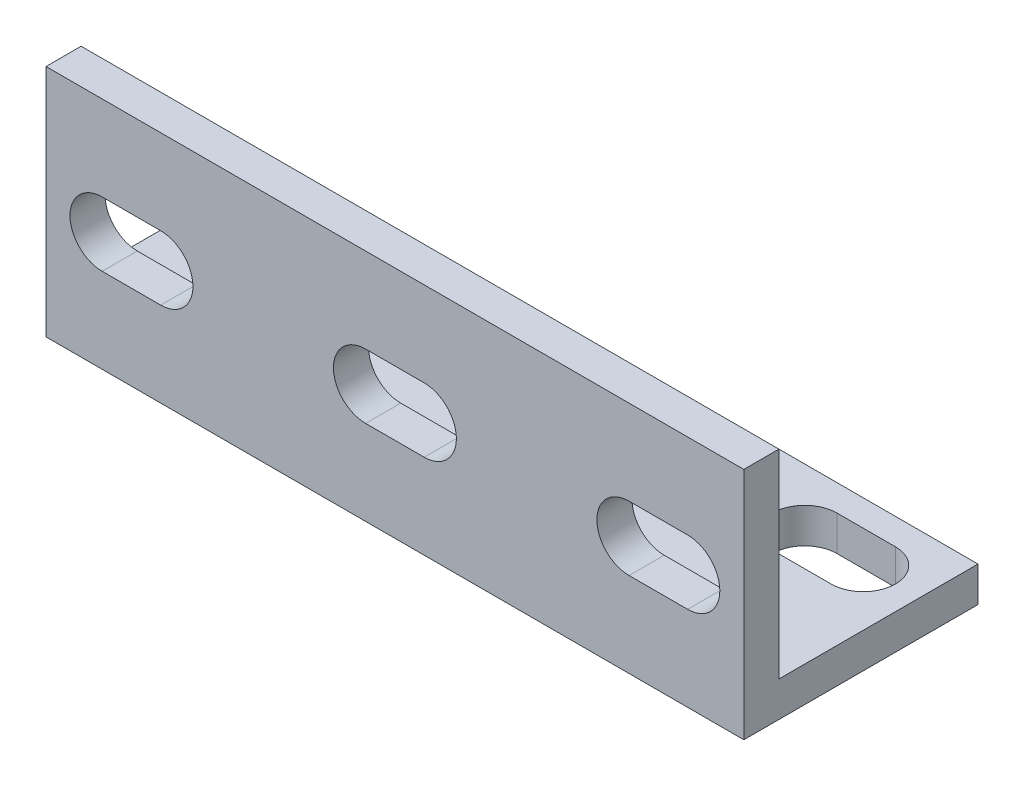
ISO-10303-21;
HEADER;
FILE_DESCRIPTION(('STEP AP214'),'2;1');
FILE_NAME('part.step','',(''),(''),'','','');
FILE_SCHEMA(('AUTOMOTIVE_DESIGN { 1 0 10303 214 1 1 1 1 }'));
ENDSEC;
DATA;
#1=APPLICATION_CONTEXT('core data for automotive mechanical design processes');
#2=APPLICATION_PROTOCOL_DEFINITION('international standard','automotive_design',2000,#1);
#3=PRODUCT_CONTEXT('',#1,'mechanical');
#4=PRODUCT('Part','Part','',(#3));
#5=PRODUCT_RELATED_PRODUCT_CATEGORY('part','',(#4));
#6=PRODUCT_DEFINITION_FORMATION('','',#4);
#7=PRODUCT_DEFINITION_CONTEXT('part definition',#1,'design');
#8=PRODUCT_DEFINITION('design','',#6,#7);
#9=PRODUCT_DEFINITION_SHAPE('','',#8);
#10=(LENGTH_UNIT() NAMED_UNIT(*) SI_UNIT(.MILLI.,.METRE.));
#11=(NAMED_UNIT(*) PLANE_ANGLE_UNIT() SI_UNIT($,.RADIAN.));
#12=(NAMED_UNIT(*) SI_UNIT($,.STERADIAN.) SOLID_ANGLE_UNIT());
#13=UNCERTAINTY_MEASURE_WITH_UNIT(LENGTH_MEASURE(1.E-05),#10,'distance_accuracy_value','');
#14=(GEOMETRIC_REPRESENTATION_CONTEXT(3) GLOBAL_UNCERTAINTY_ASSIGNED_CONTEXT((#13)) GLOBAL_UNIT_ASSIGNED_CONTEXT((#10,
#11,#12)) REPRESENTATION_CONTEXT('',''));
#15=CARTESIAN_POINT('',(0.,0.,0.));
#16=DIRECTION('',(0.,0.,1.));
#17=DIRECTION('',(1.,0.,0.));
#18=AXIS2_PLACEMENT_3D('',#15,#16,#17);
#19=CARTESIAN_POINT('',(-59.6,20.,-3.));
#20=DIRECTION('',(0.,1.,0.));
#21=DIRECTION('',(0.,0.,1.));
#22=AXIS2_PLACEMENT_3D('',#19,#20,#21);
#23=PLANE('',#22);
#24=DIRECTION('',(0.,0.,1.));
#25=VECTOR('',#24,1.);
#26=CARTESIAN_POINT('',(0.,20.,-3.));
#27=LINE('',#26,#25);
#28=CARTESIAN_POINT('',(0.,20.,-3.));
#29=VERTEX_POINT('',#28);
#30=CARTESIAN_POINT('',(0.,20.,0.));
#31=VERTEX_POINT('',#30);
#32=EDGE_CURVE('E416',#29,#31,#27,.T.);
#33=ORIENTED_EDGE('',*,*,#32,.F.);
#34=DIRECTION('',(1.,0.,0.));
#35=VECTOR('',#34,1.);
#36=CARTESIAN_POINT('',(-59.6,20.,-3.));
#37=LINE('',#36,#35);
#38=CARTESIAN_POINT('',(-59.6,20.,-3.));
#39=VERTEX_POINT('',#38);
#40=EDGE_CURVE('E11',#39,#29,#37,.T.);
#41=ORIENTED_EDGE('',*,*,#40,.F.);
#42=DIRECTION('',(0.,0.,1.));
#43=VECTOR('',#42,1.);
#44=CARTESIAN_POINT('',(-59.6,20.,-3.));
#45=LINE('',#44,#43);
#46=CARTESIAN_POINT('',(-59.6,20.,0.));
#47=VERTEX_POINT('',#46);
#48=EDGE_CURVE('E423',#39,#47,#45,.T.);
#49=ORIENTED_EDGE('',*,*,#48,.T.);
#50=DIRECTION('',(1.,0.,0.));
#51=VECTOR('',#50,1.);
#52=CARTESIAN_POINT('',(-59.6,20.,0.));
#53=LINE('',#52,#51);
#54=EDGE_CURVE('E35',#47,#31,#53,.T.);
#55=ORIENTED_EDGE('',*,*,#54,.T.);
#56=EDGE_LOOP('',(#33,#41,#49,#55));
#57=FACE_BOUND('',#56,.T.);
#58=ADVANCED_FACE('F32',(#57),#23,.T.);
#59=CARTESIAN_POINT('',(-59.6,3.,-3.));
#60=DIRECTION('',(0.,0.,-1.));
#61=DIRECTION('',(0.,1.,0.));
#62=AXIS2_PLACEMENT_3D('',#59,#60,#61);
#63=PLANE('',#62);
#64=CARTESIAN_POINT('',(-49.8,10.,-3.));
#65=DIRECTION('',(0.,0.,-1.));
#66=DIRECTION('',(0.,1.,0.));
#67=AXIS2_PLACEMENT_3D('',#64,#65,#66);
#68=CIRCLE('',#67,2.75);
#69=CARTESIAN_POINT('',(-49.8,12.75,-3.));
#70=VERTEX_POINT('',#69);
#71=CARTESIAN_POINT('',(-49.8,7.25000000000001,-3.));
#72=VERTEX_POINT('',#71);
#73=EDGE_CURVE('E323',#70,#72,#68,.T.);
#74=ORIENTED_EDGE('',*,*,#73,.F.);
#75=DIRECTION('',(-1.,0.,0.));
#76=VECTOR('',#75,1.);
#77=CARTESIAN_POINT('',(-49.8,12.75,-3.));
#78=LINE('',#77,#76);
#79=CARTESIAN_POINT('',(-54.8,12.75,-3.));
#80=VERTEX_POINT('',#79);
#81=EDGE_CURVE('E334',#70,#80,#78,.T.);
#82=ORIENTED_EDGE('',*,*,#81,.T.);
#83=CARTESIAN_POINT('',(-54.8,10.,-3.));
#84=DIRECTION('',(0.,0.,-1.));
#85=DIRECTION('',(0.,1.,0.));
#86=AXIS2_PLACEMENT_3D('',#83,#84,#85);
#87=CIRCLE('',#86,2.75);
#88=CARTESIAN_POINT('',(-54.8,7.25000000000001,-3.));
#89=VERTEX_POINT('',#88);
#90=EDGE_CURVE('E347',#89,#80,#87,.T.);
#91=ORIENTED_EDGE('',*,*,#90,.F.);
#92=DIRECTION('',(-1.,0.,0.));
#93=VECTOR('',#92,1.);
#94=CARTESIAN_POINT('',(-49.8,7.25000000000001,-3.));
#95=LINE('',#94,#93);
#96=EDGE_CURVE('E344',#72,#89,#95,.T.);
#97=ORIENTED_EDGE('',*,*,#96,.F.);
#98=EDGE_LOOP('',(#74,#82,#91,#97));
#99=FACE_BOUND('',#98,.T.);
#100=CARTESIAN_POINT('',(-4.8,10.,-3.));
#101=DIRECTION('',(0.,0.,-1.));
#102=DIRECTION('',(0.,1.,0.));
#103=AXIS2_PLACEMENT_3D('',#100,#101,#102);
#104=CIRCLE('',#103,2.75);
#105=CARTESIAN_POINT('',(-4.8,12.75,-3.));
#106=VERTEX_POINT('',#105);
#107=CARTESIAN_POINT('',(-4.80000000000001,7.25000000000001,-3.));
#108=VERTEX_POINT('',#107);
#109=EDGE_CURVE('E354',#106,#108,#104,.T.);
#110=ORIENTED_EDGE('',*,*,#109,.F.);
#111=DIRECTION('',(-1.,0.,0.));
#112=VECTOR('',#111,1.);
#113=CARTESIAN_POINT('',(-4.8,12.75,-3.));
#114=LINE('',#113,#112);
#115=CARTESIAN_POINT('',(-9.8,12.75,-3.));
#116=VERTEX_POINT('',#115);
#117=EDGE_CURVE('E365',#106,#116,#114,.T.);
#118=ORIENTED_EDGE('',*,*,#117,.T.);
#119=CARTESIAN_POINT('',(-9.8,10.,-3.));
#120=DIRECTION('',(0.,0.,-1.));
#121=DIRECTION('',(0.,1.,0.));
#122=AXIS2_PLACEMENT_3D('',#119,#120,#121);
#123=CIRCLE('',#122,2.75);
#124=CARTESIAN_POINT('',(-9.8,7.25000000000001,-3.));
#125=VERTEX_POINT('',#124);
#126=EDGE_CURVE('E378',#125,#116,#123,.T.);
#127=ORIENTED_EDGE('',*,*,#126,.F.);
#128=DIRECTION('',(-1.,0.,0.));
#129=VECTOR('',#128,1.);
#130=CARTESIAN_POINT('',(-4.8,7.25000000000001,-3.));
#131=LINE('',#130,#129);
#132=EDGE_CURVE('E375',#108,#125,#131,.T.);
#133=ORIENTED_EDGE('',*,*,#132,.F.);
#134=EDGE_LOOP('',(#110,#118,#127,#133));
#135=FACE_BOUND('',#134,.T.);
#136=CARTESIAN_POINT('',(-27.3,10.,-3.));
#137=DIRECTION('',(0.,0.,-1.));
#138=DIRECTION('',(0.,1.,0.));
#139=AXIS2_PLACEMENT_3D('',#136,#137,#138);
#140=CIRCLE('',#139,2.75);
#141=CARTESIAN_POINT('',(-27.3,12.75,-3.));
#142=VERTEX_POINT('',#141);
#143=CARTESIAN_POINT('',(-27.3,7.25000000000001,-3.));
#144=VERTEX_POINT('',#143);
#145=EDGE_CURVE('E385',#142,#144,#140,.T.);
#146=ORIENTED_EDGE('',*,*,#145,.F.);
#147=DIRECTION('',(-1.,0.,0.));
#148=VECTOR('',#147,1.);
#149=CARTESIAN_POINT('',(-27.3,12.75,-3.));
#150=LINE('',#149,#148);
#151=CARTESIAN_POINT('',(-32.3,12.75,-3.));
#152=VERTEX_POINT('',#151);
#153=EDGE_CURVE('E396',#142,#152,#150,.T.);
#154=ORIENTED_EDGE('',*,*,#153,.T.);
#155=CARTESIAN_POINT('',(-32.3,10.,-3.));
#156=DIRECTION('',(0.,0.,-1.));
#157=DIRECTION('',(0.,1.,0.));
#158=AXIS2_PLACEMENT_3D('',#155,#156,#157);
#159=CIRCLE('',#158,2.75);
#160=CARTESIAN_POINT('',(-32.3,7.25000000000001,-3.));
#161=VERTEX_POINT('',#160);
#162=EDGE_CURVE('E409',#161,#152,#159,.T.);
#163=ORIENTED_EDGE('',*,*,#162,.F.);
#164=DIRECTION('',(-1.,0.,0.));
#165=VECTOR('',#164,1.);
#166=CARTESIAN_POINT('',(-27.3,7.25000000000001,-3.));
#167=LINE('',#166,#165);
#168=EDGE_CURVE('E406',#144,#161,#167,.T.);
#169=ORIENTED_EDGE('',*,*,#168,.F.);
#170=EDGE_LOOP('',(#146,#154,#163,#169));
#171=FACE_BOUND('',#170,.T.);
#172=DIRECTION('',(0.,1.,0.));
#173=VECTOR('',#172,1.);
#174=CARTESIAN_POINT('',(0.,3.,-3.));
#175=LINE('',#174,#173);
#176=CARTESIAN_POINT('',(0.,3.,-3.));
#177=VERTEX_POINT('',#176);
#178=EDGE_CURVE('E427',#177,#29,#175,.T.);
#179=ORIENTED_EDGE('',*,*,#178,.F.);
#180=DIRECTION('',(1.,0.,0.));
#181=VECTOR('',#180,1.);
#182=CARTESIAN_POINT('',(-59.6,3.,-3.));
#183=LINE('',#182,#181);
#184=CARTESIAN_POINT('',(-59.6,3.,-3.));
#185=VERTEX_POINT('',#184);
#186=EDGE_CURVE('E40',#185,#177,#183,.T.);
#187=ORIENTED_EDGE('',*,*,#186,.F.);
#188=DIRECTION('',(0.,1.,0.));
#189=VECTOR('',#188,1.);
#190=CARTESIAN_POINT('',(-59.6,3.,-3.));
#191=LINE('',#190,#189);
#192=EDGE_CURVE('E439',#185,#39,#191,.T.);
#193=ORIENTED_EDGE('',*,*,#192,.T.);
#194=ORIENTED_EDGE('',*,*,#40,.T.);
#195=EDGE_LOOP('',(#179,#187,#193,#194));
#196=FACE_BOUND('',#195,.T.);
#197=ADVANCED_FACE('F476',(#99,#135,#171,#196),#63,.T.);
#198=CARTESIAN_POINT('',(-59.6,3.,-20.));
#199=DIRECTION('',(0.,1.,0.));
#200=DIRECTION('',(0.,0.,1.));
#201=AXIS2_PLACEMENT_3D('',#198,#199,#200);
#202=PLANE('',#201);
#203=CARTESIAN_POINT('',(-49.8,3.,-15.));
#204=DIRECTION('',(0.,1.,0.));
#205=DIRECTION('',(0.,0.,1.));
#206=AXIS2_PLACEMENT_3D('',#203,#204,#205);
#207=CIRCLE('',#206,2.75);
#208=CARTESIAN_POINT('',(-49.8,3.,-12.25));
#209=VERTEX_POINT('',#208);
#210=CARTESIAN_POINT('',(-49.8,3.,-17.75));
#211=VERTEX_POINT('',#210);
#212=EDGE_CURVE('E48',#209,#211,#207,.T.);
#213=ORIENTED_EDGE('',*,*,#212,.F.);
#214=DIRECTION('',(1.,0.,0.));
#215=VECTOR('',#214,1.);
#216=CARTESIAN_POINT('',(-49.8,3.,-12.25));
#217=LINE('',#216,#215);
#218=CARTESIAN_POINT('',(-54.8,3.,-12.25));
#219=VERTEX_POINT('',#218);
#220=EDGE_CURVE('E247',#219,#209,#217,.T.);
#221=ORIENTED_EDGE('',*,*,#220,.F.);
#222=CARTESIAN_POINT('',(-54.8,3.,-15.));
#223=DIRECTION('',(0.,1.,0.));
#224=DIRECTION('',(0.,0.,1.));
#225=AXIS2_PLACEMENT_3D('',#222,#223,#224);
#226=CIRCLE('',#225,2.75);
#227=CARTESIAN_POINT('',(-54.8,3.,-17.75));
#228=VERTEX_POINT('',#227);
#229=EDGE_CURVE('E250',#228,#219,#226,.T.);
#230=ORIENTED_EDGE('',*,*,#229,.F.);
#231=DIRECTION('',(-1.,0.,0.));
#232=VECTOR('',#231,1.);
#233=CARTESIAN_POINT('',(-49.8,3.,-17.75));
#234=LINE('',#233,#232);
#235=EDGE_CURVE('E256',#211,#228,#234,.T.);
#236=ORIENTED_EDGE('',*,*,#235,.F.);
#237=EDGE_LOOP('',(#213,#221,#230,#236));
#238=FACE_BOUND('',#237,.T.);
#239=CARTESIAN_POINT('',(-4.8,3.,-15.));
#240=DIRECTION('',(0.,1.,0.));
#241=DIRECTION('',(0.,0.,1.));
#242=AXIS2_PLACEMENT_3D('',#239,#240,#241);
#243=CIRCLE('',#242,2.75);
#244=CARTESIAN_POINT('',(-4.80000000000001,3.,-12.25));
#245=VERTEX_POINT('',#244);
#246=CARTESIAN_POINT('',(-4.80000000000001,3.,-17.75));
#247=VERTEX_POINT('',#246);
#248=EDGE_CURVE('E262',#245,#247,#243,.T.);
#249=ORIENTED_EDGE('',*,*,#248,.F.);
#250=DIRECTION('',(1.,0.,0.));
#251=VECTOR('',#250,1.);
#252=CARTESIAN_POINT('',(-4.80000000000001,3.,-12.25));
#253=LINE('',#252,#251);
#254=CARTESIAN_POINT('',(-9.8,3.,-12.25));
#255=VERTEX_POINT('',#254);
#256=EDGE_CURVE('E270',#255,#245,#253,.T.);
#257=ORIENTED_EDGE('',*,*,#256,.F.);
#258=CARTESIAN_POINT('',(-9.8,3.,-15.));
#259=DIRECTION('',(0.,1.,0.));
#260=DIRECTION('',(0.,0.,1.));
#261=AXIS2_PLACEMENT_3D('',#258,#259,#260);
#262=CIRCLE('',#261,2.75);
#263=CARTESIAN_POINT('',(-9.8,3.,-17.75));
#264=VERTEX_POINT('',#263);
#265=EDGE_CURVE('E284',#264,#255,#262,.T.);
#266=ORIENTED_EDGE('',*,*,#265,.F.);
#267=DIRECTION('',(-1.,0.,0.));
#268=VECTOR('',#267,1.);
#269=CARTESIAN_POINT('',(-4.8,3.,-17.75));
#270=LINE('',#269,#268);
#271=EDGE_CURVE('E281',#247,#264,#270,.T.);
#272=ORIENTED_EDGE('',*,*,#271,.F.);
#273=EDGE_LOOP('',(#249,#257,#266,#272));
#274=FACE_BOUND('',#273,.T.);
#275=CARTESIAN_POINT('',(-27.3,3.,-15.));
#276=DIRECTION('',(0.,1.,0.));
#277=DIRECTION('',(0.,0.,1.));
#278=AXIS2_PLACEMENT_3D('',#275,#276,#277);
#279=CIRCLE('',#278,2.75);
#280=CARTESIAN_POINT('',(-27.3,3.,-12.25));
#281=VERTEX_POINT('',#280);
#282=CARTESIAN_POINT('',(-27.3,3.,-17.75));
#283=VERTEX_POINT('',#282);
#284=EDGE_CURVE('E291',#281,#283,#279,.T.);
#285=ORIENTED_EDGE('',*,*,#284,.F.);
#286=DIRECTION('',(1.,0.,0.));
#287=VECTOR('',#286,1.);
#288=CARTESIAN_POINT('',(-27.3,3.,-12.25));
#289=LINE('',#288,#287);
#290=CARTESIAN_POINT('',(-32.3,3.,-12.25));
#291=VERTEX_POINT('',#290);
#292=EDGE_CURVE('E302',#291,#281,#289,.T.);
#293=ORIENTED_EDGE('',*,*,#292,.F.);
#294=CARTESIAN_POINT('',(-32.3,3.,-15.));
#295=DIRECTION('',(0.,1.,0.));
#296=DIRECTION('',(0.,0.,1.));
#297=AXIS2_PLACEMENT_3D('',#294,#295,#296);
#298=CIRCLE('',#297,2.75);
#299=CARTESIAN_POINT('',(-32.3,3.,-17.75));
#300=VERTEX_POINT('',#299);
#301=EDGE_CURVE('E316',#300,#291,#298,.T.);
#302=ORIENTED_EDGE('',*,*,#301,.F.);
#303=DIRECTION('',(-1.,0.,0.));
#304=VECTOR('',#303,1.);
#305=CARTESIAN_POINT('',(-27.3,3.,-17.75));
#306=LINE('',#305,#304);
#307=EDGE_CURVE('E313',#283,#300,#306,.T.);
#308=ORIENTED_EDGE('',*,*,#307,.F.);
#309=EDGE_LOOP('',(#285,#293,#302,#308));
#310=FACE_BOUND('',#309,.T.);
#311=DIRECTION('',(0.,0.,1.));
#312=VECTOR('',#311,1.);
#313=CARTESIAN_POINT('',(0.,3.,-20.));
#314=LINE('',#313,#312);
#315=CARTESIAN_POINT('',(0.,3.,-20.));
#316=VERTEX_POINT('',#315);
#317=EDGE_CURVE('E453',#316,#177,#314,.T.);
#318=ORIENTED_EDGE('',*,*,#317,.F.);
#319=DIRECTION('',(1.,0.,0.));
#320=VECTOR('',#319,1.);
#321=CARTESIAN_POINT('',(-59.6,3.,-20.));
#322=LINE('',#321,#320);
#323=CARTESIAN_POINT('',(-59.6,3.,-20.));
#324=VERTEX_POINT('',#323);
#325=EDGE_CURVE('E459',#324,#316,#322,.T.);
#326=ORIENTED_EDGE('',*,*,#325,.F.);
#327=DIRECTION('',(0.,0.,1.));
#328=VECTOR('',#327,1.);
#329=CARTESIAN_POINT('',(-59.6,3.,-20.));
#330=LINE('',#329,#328);
#331=EDGE_CURVE('E436',#324,#185,#330,.T.);
#332=ORIENTED_EDGE('',*,*,#331,.T.);
#333=ORIENTED_EDGE('',*,*,#186,.T.);
#334=EDGE_LOOP('',(#318,#326,#332,#333));
#335=FACE_BOUND('',#334,.T.);
#336=ADVANCED_FACE('F488',(#238,#274,#310,#335),#202,.T.);
#337=CARTESIAN_POINT('',(-59.6,0.,-20.));
#338=DIRECTION('',(0.,0.,-1.));
#339=DIRECTION('',(-1.,0.,0.));
#340=AXIS2_PLACEMENT_3D('',#337,#338,#339);
#341=PLANE('',#340);
#342=DIRECTION('',(0.,1.,0.));
#343=VECTOR('',#342,1.);
#344=CARTESIAN_POINT('',(0.,0.,-20.));
#345=LINE('',#344,#343);
#346=CARTESIAN_POINT('',(0.,0.,-20.));
#347=VERTEX_POINT('',#346);
#348=EDGE_CURVE('E450',#347,#316,#345,.T.);
#349=ORIENTED_EDGE('',*,*,#348,.F.);
#350=DIRECTION('',(1.,0.,0.));
#351=VECTOR('',#350,1.);
#352=CARTESIAN_POINT('',(-59.6,0.,-20.));
#353=LINE('',#352,#351);
#354=CARTESIAN_POINT('',(-59.6,0.,-20.));
#355=VERTEX_POINT('',#354);
#356=EDGE_CURVE('E461',#355,#347,#353,.T.);
#357=ORIENTED_EDGE('',*,*,#356,.F.);
#358=DIRECTION('',(0.,1.,0.));
#359=VECTOR('',#358,1.);
#360=CARTESIAN_POINT('',(-59.6,0.,-20.));
#361=LINE('',#360,#359);
#362=EDGE_CURVE('E433',#355,#324,#361,.T.);
#363=ORIENTED_EDGE('',*,*,#362,.T.);
#364=ORIENTED_EDGE('',*,*,#325,.T.);
#365=EDGE_LOOP('',(#349,#357,#363,#364));
#366=FACE_BOUND('',#365,.T.);
#367=ADVANCED_FACE('F486',(#366),#341,.T.);
#368=CARTESIAN_POINT('',(-59.6,0.,0.));
#369=DIRECTION('',(0.,-1.,0.));
#370=DIRECTION('',(0.,0.,-1.));
#371=AXIS2_PLACEMENT_3D('',#368,#369,#370);
#372=PLANE('',#371);
#373=CARTESIAN_POINT('',(-49.8,0.,-15.));
#374=DIRECTION('',(0.,1.,0.));
#375=DIRECTION('',(0.,0.,1.));
#376=AXIS2_PLACEMENT_3D('',#373,#374,#375);
#377=CIRCLE('',#376,2.75);
#378=CARTESIAN_POINT('',(-49.8,0.,-12.25));
#379=VERTEX_POINT('',#378);
#380=CARTESIAN_POINT('',(-49.8,0.,-17.75));
#381=VERTEX_POINT('',#380);
#382=EDGE_CURVE('E231',#379,#381,#377,.T.);
#383=ORIENTED_EDGE('',*,*,#382,.T.);
#384=DIRECTION('',(-1.,0.,0.));
#385=VECTOR('',#384,1.);
#386=CARTESIAN_POINT('',(-49.8,0.,-17.75));
#387=LINE('',#386,#385);
#388=CARTESIAN_POINT('',(-54.8,0.,-17.75));
#389=VERTEX_POINT('',#388);
#390=EDGE_CURVE('E240',#381,#389,#387,.T.);
#391=ORIENTED_EDGE('',*,*,#390,.T.);
#392=CARTESIAN_POINT('',(-54.8,0.,-15.));
#393=DIRECTION('',(0.,1.,0.));
#394=DIRECTION('',(0.,0.,1.));
#395=AXIS2_PLACEMENT_3D('',#392,#393,#394);
#396=CIRCLE('',#395,2.75);
#397=CARTESIAN_POINT('',(-54.8,0.,-12.25));
#398=VERTEX_POINT('',#397);
#399=EDGE_CURVE('E56',#389,#398,#396,.T.);
#400=ORIENTED_EDGE('',*,*,#399,.T.);
#401=DIRECTION('',(1.,0.,0.));
#402=VECTOR('',#401,1.);
#403=CARTESIAN_POINT('',(-49.8,0.,-12.25));
#404=LINE('',#403,#402);
#405=EDGE_CURVE('E237',#398,#379,#404,.T.);
#406=ORIENTED_EDGE('',*,*,#405,.T.);
#407=EDGE_LOOP('',(#383,#391,#400,#406));
#408=FACE_BOUND('',#407,.T.);
#409=CARTESIAN_POINT('',(-4.8,0.,-15.));
#410=DIRECTION('',(0.,1.,0.));
#411=DIRECTION('',(0.,0.,1.));
#412=AXIS2_PLACEMENT_3D('',#409,#410,#411);
#413=CIRCLE('',#412,2.75);
#414=CARTESIAN_POINT('',(-4.80000000000001,0.,-12.25));
#415=VERTEX_POINT('',#414);
#416=CARTESIAN_POINT('',(-4.8,0.,-17.75));
#417=VERTEX_POINT('',#416);
#418=EDGE_CURVE('E266',#415,#417,#413,.T.);
#419=ORIENTED_EDGE('',*,*,#418,.T.);
#420=DIRECTION('',(-1.,0.,0.));
#421=VECTOR('',#420,1.);
#422=CARTESIAN_POINT('',(-4.8,0.,-17.75));
#423=LINE('',#422,#421);
#424=CARTESIAN_POINT('',(-9.8,0.,-17.75));
#425=VERTEX_POINT('',#424);
#426=EDGE_CURVE('E269',#417,#425,#423,.T.);
#427=ORIENTED_EDGE('',*,*,#426,.T.);
#428=CARTESIAN_POINT('',(-9.8,0.,-15.));
#429=DIRECTION('',(0.,1.,0.));
#430=DIRECTION('',(0.,0.,1.));
#431=AXIS2_PLACEMENT_3D('',#428,#429,#430);
#432=CIRCLE('',#431,2.75);
#433=CARTESIAN_POINT('',(-9.8,0.,-12.25));
#434=VERTEX_POINT('',#433);
#435=EDGE_CURVE('E273',#425,#434,#432,.T.);
#436=ORIENTED_EDGE('',*,*,#435,.T.);
#437=DIRECTION('',(1.,0.,0.));
#438=VECTOR('',#437,1.);
#439=CARTESIAN_POINT('',(-4.80000000000001,0.,-12.25));
#440=LINE('',#439,#438);
#441=EDGE_CURVE('E276',#434,#415,#440,.T.);
#442=ORIENTED_EDGE('',*,*,#441,.T.);
#443=EDGE_LOOP('',(#419,#427,#436,#442));
#444=FACE_BOUND('',#443,.T.);
#445=CARTESIAN_POINT('',(-27.3,0.,-15.));
#446=DIRECTION('',(0.,1.,0.));
#447=DIRECTION('',(0.,0.,1.));
#448=AXIS2_PLACEMENT_3D('',#445,#446,#447);
#449=CIRCLE('',#448,2.75);
#450=CARTESIAN_POINT('',(-27.3,0.,-12.25));
#451=VERTEX_POINT('',#450);
#452=CARTESIAN_POINT('',(-27.3,0.,-17.75));
#453=VERTEX_POINT('',#452);
#454=EDGE_CURVE('E298',#451,#453,#449,.T.);
#455=ORIENTED_EDGE('',*,*,#454,.T.);
#456=DIRECTION('',(-1.,0.,0.));
#457=VECTOR('',#456,1.);
#458=CARTESIAN_POINT('',(-27.3,0.,-17.75));
#459=LINE('',#458,#457);
#460=CARTESIAN_POINT('',(-32.3,0.,-17.75));
#461=VERTEX_POINT('',#460);
#462=EDGE_CURVE('E301',#453,#461,#459,.T.);
#463=ORIENTED_EDGE('',*,*,#462,.T.);
#464=CARTESIAN_POINT('',(-32.3,0.,-15.));
#465=DIRECTION('',(0.,1.,0.));
#466=DIRECTION('',(0.,0.,1.));
#467=AXIS2_PLACEMENT_3D('',#464,#465,#466);
#468=CIRCLE('',#467,2.75);
#469=CARTESIAN_POINT('',(-32.3,0.,-12.25));
#470=VERTEX_POINT('',#469);
#471=EDGE_CURVE('E305',#461,#470,#468,.T.);
#472=ORIENTED_EDGE('',*,*,#471,.T.);
#473=DIRECTION('',(1.,0.,0.));
#474=VECTOR('',#473,1.);
#475=CARTESIAN_POINT('',(-27.3,0.,-12.25));
#476=LINE('',#475,#474);
#477=EDGE_CURVE('E308',#470,#451,#476,.T.);
#478=ORIENTED_EDGE('',*,*,#477,.T.);
#479=EDGE_LOOP('',(#455,#463,#472,#478));
#480=FACE_BOUND('',#479,.T.);
#481=DIRECTION('',(0.,0.,-1.));
#482=VECTOR('',#481,1.);
#483=CARTESIAN_POINT('',(0.,0.,0.));
#484=LINE('',#483,#482);
#485=CARTESIAN_POINT('',(0.,0.,0.));
#486=VERTEX_POINT('',#485);
#487=EDGE_CURVE('E447',#486,#347,#484,.T.);
#488=ORIENTED_EDGE('',*,*,#487,.F.);
#489=DIRECTION('',(1.,0.,0.));
#490=VECTOR('',#489,1.);
#491=CARTESIAN_POINT('',(-59.6,0.,0.));
#492=LINE('',#491,#490);
#493=CARTESIAN_POINT('',(-59.6,0.,0.));
#494=VERTEX_POINT('',#493);
#495=EDGE_CURVE('E462',#494,#486,#492,.T.);
#496=ORIENTED_EDGE('',*,*,#495,.F.);
#497=DIRECTION('',(0.,0.,-1.));
#498=VECTOR('',#497,1.);
#499=CARTESIAN_POINT('',(-59.6,0.,0.));
#500=LINE('',#499,#498);
#501=EDGE_CURVE('E430',#494,#355,#500,.T.);
#502=ORIENTED_EDGE('',*,*,#501,.T.);
#503=ORIENTED_EDGE('',*,*,#356,.T.);
#504=EDGE_LOOP('',(#488,#496,#502,#503));
#505=FACE_BOUND('',#504,.T.);
#506=ADVANCED_FACE('F244',(#408,#444,#480,#505),#372,.T.);
#507=CARTESIAN_POINT('',(-59.6,20.,0.));
#508=DIRECTION('',(0.,0.,1.));
#509=DIRECTION('',(0.,-1.,0.));
#510=AXIS2_PLACEMENT_3D('',#507,#508,#509);
#511=PLANE('',#510);
#512=CARTESIAN_POINT('',(-49.8,10.,0.));
#513=DIRECTION('',(0.,0.,-1.));
#514=DIRECTION('',(0.,1.,0.));
#515=AXIS2_PLACEMENT_3D('',#512,#513,#514);
#516=CIRCLE('',#515,2.75);
#517=CARTESIAN_POINT('',(-49.8,12.75,0.));
#518=VERTEX_POINT('',#517);
#519=CARTESIAN_POINT('',(-49.8,7.25000000000001,0.));
#520=VERTEX_POINT('',#519);
#521=EDGE_CURVE('E330',#518,#520,#516,.T.);
#522=ORIENTED_EDGE('',*,*,#521,.T.);
#523=DIRECTION('',(-1.,0.,0.));
#524=VECTOR('',#523,1.);
#525=CARTESIAN_POINT('',(-49.8,7.25000000000001,0.));
#526=LINE('',#525,#524);
#527=CARTESIAN_POINT('',(-54.8,7.25000000000001,0.));
#528=VERTEX_POINT('',#527);
#529=EDGE_CURVE('E333',#520,#528,#526,.T.);
#530=ORIENTED_EDGE('',*,*,#529,.T.);
#531=CARTESIAN_POINT('',(-54.8,10.,0.));
#532=DIRECTION('',(0.,0.,-1.));
#533=DIRECTION('',(0.,1.,0.));
#534=AXIS2_PLACEMENT_3D('',#531,#532,#533);
#535=CIRCLE('',#534,2.75);
#536=CARTESIAN_POINT('',(-54.8,12.75,0.));
#537=VERTEX_POINT('',#536);
#538=EDGE_CURVE('E337',#528,#537,#535,.T.);
#539=ORIENTED_EDGE('',*,*,#538,.T.);
#540=DIRECTION('',(-1.,0.,0.));
#541=VECTOR('',#540,1.);
#542=CARTESIAN_POINT('',(-49.8,12.75,0.));
#543=LINE('',#542,#541);
#544=EDGE_CURVE('E340',#518,#537,#543,.T.);
#545=ORIENTED_EDGE('',*,*,#544,.F.);
#546=EDGE_LOOP('',(#522,#530,#539,#545));
#547=FACE_BOUND('',#546,.T.);
#548=CARTESIAN_POINT('',(-4.8,10.,0.));
#549=DIRECTION('',(0.,0.,-1.));
#550=DIRECTION('',(0.,1.,0.));
#551=AXIS2_PLACEMENT_3D('',#548,#549,#550);
#552=CIRCLE('',#551,2.75);
#553=CARTESIAN_POINT('',(-4.8,12.75,0.));
#554=VERTEX_POINT('',#553);
#555=CARTESIAN_POINT('',(-4.8,7.25000000000001,0.));
#556=VERTEX_POINT('',#555);
#557=EDGE_CURVE('E361',#554,#556,#552,.T.);
#558=ORIENTED_EDGE('',*,*,#557,.T.);
#559=DIRECTION('',(-1.,0.,0.));
#560=VECTOR('',#559,1.);
#561=CARTESIAN_POINT('',(-4.8,7.25000000000001,0.));
#562=LINE('',#561,#560);
#563=CARTESIAN_POINT('',(-9.8,7.25000000000001,0.));
#564=VERTEX_POINT('',#563);
#565=EDGE_CURVE('E364',#556,#564,#562,.T.);
#566=ORIENTED_EDGE('',*,*,#565,.T.);
#567=CARTESIAN_POINT('',(-9.8,10.,0.));
#568=DIRECTION('',(0.,0.,-1.));
#569=DIRECTION('',(0.,1.,0.));
#570=AXIS2_PLACEMENT_3D('',#567,#568,#569);
#571=CIRCLE('',#570,2.75);
#572=CARTESIAN_POINT('',(-9.8,12.75,0.));
#573=VERTEX_POINT('',#572);
#574=EDGE_CURVE('E368',#564,#573,#571,.T.);
#575=ORIENTED_EDGE('',*,*,#574,.T.);
#576=DIRECTION('',(-1.,0.,0.));
#577=VECTOR('',#576,1.);
#578=CARTESIAN_POINT('',(-4.8,12.75,0.));
#579=LINE('',#578,#577);
#580=EDGE_CURVE('E371',#554,#573,#579,.T.);
#581=ORIENTED_EDGE('',*,*,#580,.F.);
#582=EDGE_LOOP('',(#558,#566,#575,#581));
#583=FACE_BOUND('',#582,.T.);
#584=CARTESIAN_POINT('',(-27.3,10.,0.));
#585=DIRECTION('',(0.,0.,-1.));
#586=DIRECTION('',(0.,1.,0.));
#587=AXIS2_PLACEMENT_3D('',#584,#585,#586);
#588=CIRCLE('',#587,2.75);
#589=CARTESIAN_POINT('',(-27.3,12.75,0.));
#590=VERTEX_POINT('',#589);
#591=CARTESIAN_POINT('',(-27.3,7.25000000000001,0.));
#592=VERTEX_POINT('',#591);
#593=EDGE_CURVE('E392',#590,#592,#588,.T.);
#594=ORIENTED_EDGE('',*,*,#593,.T.);
#595=DIRECTION('',(-1.,0.,0.));
#596=VECTOR('',#595,1.);
#597=CARTESIAN_POINT('',(-27.3,7.25000000000001,0.));
#598=LINE('',#597,#596);
#599=CARTESIAN_POINT('',(-32.3,7.25000000000001,0.));
#600=VERTEX_POINT('',#599);
#601=EDGE_CURVE('E395',#592,#600,#598,.T.);
#602=ORIENTED_EDGE('',*,*,#601,.T.);
#603=CARTESIAN_POINT('',(-32.3,10.,0.));
#604=DIRECTION('',(0.,0.,-1.));
#605=DIRECTION('',(0.,1.,0.));
#606=AXIS2_PLACEMENT_3D('',#603,#604,#605);
#607=CIRCLE('',#606,2.75);
#608=CARTESIAN_POINT('',(-32.3,12.75,0.));
#609=VERTEX_POINT('',#608);
#610=EDGE_CURVE('E399',#600,#609,#607,.T.);
#611=ORIENTED_EDGE('',*,*,#610,.T.);
#612=DIRECTION('',(-1.,0.,0.));
#613=VECTOR('',#612,1.);
#614=CARTESIAN_POINT('',(-27.3,12.75,0.));
#615=LINE('',#614,#613);
#616=EDGE_CURVE('E402',#590,#609,#615,.T.);
#617=ORIENTED_EDGE('',*,*,#616,.F.);
#618=EDGE_LOOP('',(#594,#602,#611,#617));
#619=FACE_BOUND('',#618,.T.);
#620=DIRECTION('',(0.,-1.,0.));
#621=VECTOR('',#620,1.);
#622=CARTESIAN_POINT('',(0.,20.,0.));
#623=LINE('',#622,#621);
#624=EDGE_CURVE('E444',#31,#486,#623,.T.);
#625=ORIENTED_EDGE('',*,*,#624,.F.);
#626=ORIENTED_EDGE('',*,*,#54,.F.);
#627=DIRECTION('',(0.,-1.,0.));
#628=VECTOR('',#627,1.);
#629=CARTESIAN_POINT('',(-59.6,20.,0.));
#630=LINE('',#629,#628);
#631=EDGE_CURVE('E426',#47,#494,#630,.T.);
#632=ORIENTED_EDGE('',*,*,#631,.T.);
#633=ORIENTED_EDGE('',*,*,#495,.T.);
#634=EDGE_LOOP('',(#625,#626,#632,#633));
#635=FACE_BOUND('',#634,.T.);
#636=ADVANCED_FACE('F470',(#547,#583,#619,#635),#511,.T.);
#637=CARTESIAN_POINT('',(-59.6,0.,0.));
#638=DIRECTION('',(1.,0.,0.));
#639=DIRECTION('',(0.,0.,-1.));
#640=AXIS2_PLACEMENT_3D('',#637,#638,#639);
#641=PLANE('',#640);
#642=ORIENTED_EDGE('',*,*,#48,.F.);
#643=ORIENTED_EDGE('',*,*,#192,.F.);
#644=ORIENTED_EDGE('',*,*,#331,.F.);
#645=ORIENTED_EDGE('',*,*,#362,.F.);
#646=ORIENTED_EDGE('',*,*,#501,.F.);
#647=ORIENTED_EDGE('',*,*,#631,.F.);
#648=EDGE_LOOP('',(#642,#643,#644,#645,#646,#647));
#649=FACE_BOUND('',#648,.T.);
#650=ADVANCED_FACE('F479',(#649),#641,.F.);
#651=CARTESIAN_POINT('',(0.,0.,0.));
#652=DIRECTION('',(1.,0.,0.));
#653=DIRECTION('',(0.,0.,-1.));
#654=AXIS2_PLACEMENT_3D('',#651,#652,#653);
#655=PLANE('',#654);
#656=ORIENTED_EDGE('',*,*,#32,.T.);
#657=ORIENTED_EDGE('',*,*,#624,.T.);
#658=ORIENTED_EDGE('',*,*,#487,.T.);
#659=ORIENTED_EDGE('',*,*,#348,.T.);
#660=ORIENTED_EDGE('',*,*,#317,.T.);
#661=ORIENTED_EDGE('',*,*,#178,.T.);
#662=EDGE_LOOP('',(#656,#657,#658,#659,#660,#661));
#663=FACE_BOUND('',#662,.T.);
#664=ADVANCED_FACE('F472',(#663),#655,.T.);
#665=CARTESIAN_POINT('',(-27.3,10.,0.));
#666=DIRECTION('',(0.,0.,-1.));
#667=DIRECTION('',(0.,1.,0.));
#668=AXIS2_PLACEMENT_3D('',#665,#666,#667);
#669=CYLINDRICAL_SURFACE('',#668,2.75);
#670=ORIENTED_EDGE('',*,*,#145,.T.);
#671=DIRECTION('',(0.,0.,-1.));
#672=VECTOR('',#671,1.);
#673=CARTESIAN_POINT('',(-27.3,7.25000000000001,0.));
#674=LINE('',#673,#672);
#675=EDGE_CURVE('E404',#592,#144,#674,.T.);
#676=ORIENTED_EDGE('',*,*,#675,.F.);
#677=ORIENTED_EDGE('',*,*,#593,.F.);
#678=DIRECTION('',(0.,0.,-1.));
#679=VECTOR('',#678,1.);
#680=CARTESIAN_POINT('',(-27.3,12.75,0.));
#681=LINE('',#680,#679);
#682=EDGE_CURVE('E414',#590,#142,#681,.T.);
#683=ORIENTED_EDGE('',*,*,#682,.T.);
#684=EDGE_LOOP('',(#670,#676,#677,#683));
#685=FACE_BOUND('',#684,.T.);
#686=ADVANCED_FACE('F741',(#685),#669,.F.);
#687=CARTESIAN_POINT('',(-27.3,12.75,0.));
#688=DIRECTION('',(0.,-1.,0.));
#689=DIRECTION('',(0.,0.,-1.));
#690=AXIS2_PLACEMENT_3D('',#687,#688,#689);
#691=PLANE('',#690);
#692=ORIENTED_EDGE('',*,*,#153,.F.);
#693=ORIENTED_EDGE('',*,*,#682,.F.);
#694=ORIENTED_EDGE('',*,*,#616,.T.);
#695=DIRECTION('',(0.,0.,-1.));
#696=VECTOR('',#695,1.);
#697=CARTESIAN_POINT('',(-32.3,12.75,0.));
#698=LINE('',#697,#696);
#699=EDGE_CURVE('E417',#609,#152,#698,.T.);
#700=ORIENTED_EDGE('',*,*,#699,.T.);
#701=EDGE_LOOP('',(#692,#693,#694,#700));
#702=FACE_BOUND('',#701,.T.);
#703=ADVANCED_FACE('F737',(#702),#691,.T.);
#704=CARTESIAN_POINT('',(-32.3,10.,0.));
#705=DIRECTION('',(0.,0.,-1.));
#706=DIRECTION('',(0.,1.,0.));
#707=AXIS2_PLACEMENT_3D('',#704,#705,#706);
#708=CYLINDRICAL_SURFACE('',#707,2.75);
#709=ORIENTED_EDGE('',*,*,#162,.T.);
#710=ORIENTED_EDGE('',*,*,#699,.F.);
#711=ORIENTED_EDGE('',*,*,#610,.F.);
#712=DIRECTION('',(0.,0.,-1.));
#713=VECTOR('',#712,1.);
#714=CARTESIAN_POINT('',(-32.3,7.25000000000001,0.));
#715=LINE('',#714,#713);
#716=EDGE_CURVE('E419',#600,#161,#715,.T.);
#717=ORIENTED_EDGE('',*,*,#716,.T.);
#718=EDGE_LOOP('',(#709,#710,#711,#717));
#719=FACE_BOUND('',#718,.T.);
#720=ADVANCED_FACE('F740',(#719),#708,.F.);
#721=CARTESIAN_POINT('',(-27.3,7.25000000000001,0.));
#722=DIRECTION('',(0.,-1.,0.));
#723=DIRECTION('',(1.,0.,0.));
#724=AXIS2_PLACEMENT_3D('',#721,#722,#723);
#725=PLANE('',#724);
#726=ORIENTED_EDGE('',*,*,#168,.T.);
#727=ORIENTED_EDGE('',*,*,#716,.F.);
#728=ORIENTED_EDGE('',*,*,#601,.F.);
#729=ORIENTED_EDGE('',*,*,#675,.T.);
#730=EDGE_LOOP('',(#726,#727,#728,#729));
#731=FACE_BOUND('',#730,.T.);
#732=ADVANCED_FACE('F515',(#731),#725,.F.);
#733=CARTESIAN_POINT('',(-4.8,10.,0.));
#734=DIRECTION('',(0.,0.,-1.));
#735=DIRECTION('',(0.,1.,0.));
#736=AXIS2_PLACEMENT_3D('',#733,#734,#735);
#737=CYLINDRICAL_SURFACE('',#736,2.75);
#738=ORIENTED_EDGE('',*,*,#109,.T.);
#739=DIRECTION('',(0.,0.,-1.));
#740=VECTOR('',#739,1.);
#741=CARTESIAN_POINT('',(-4.8,7.25000000000001,0.));
#742=LINE('',#741,#740);
#743=EDGE_CURVE('E373',#556,#108,#742,.T.);
#744=ORIENTED_EDGE('',*,*,#743,.F.);
#745=ORIENTED_EDGE('',*,*,#557,.F.);
#746=DIRECTION('',(0.,0.,-1.));
#747=VECTOR('',#746,1.);
#748=CARTESIAN_POINT('',(-4.8,12.75,0.));
#749=LINE('',#748,#747);
#750=EDGE_CURVE('E383',#554,#106,#749,.T.);
#751=ORIENTED_EDGE('',*,*,#750,.T.);
#752=EDGE_LOOP('',(#738,#744,#745,#751));
#753=FACE_BOUND('',#752,.T.);
#754=ADVANCED_FACE('F532',(#753),#737,.F.);
#755=CARTESIAN_POINT('',(-4.8,12.75,0.));
#756=DIRECTION('',(0.,-1.,0.));
#757=DIRECTION('',(0.,0.,-1.));
#758=AXIS2_PLACEMENT_3D('',#755,#756,#757);
#759=PLANE('',#758);
#760=ORIENTED_EDGE('',*,*,#117,.F.);
#761=ORIENTED_EDGE('',*,*,#750,.F.);
#762=ORIENTED_EDGE('',*,*,#580,.T.);
#763=DIRECTION('',(0.,0.,-1.));
#764=VECTOR('',#763,1.);
#765=CARTESIAN_POINT('',(-9.8,12.75,0.));
#766=LINE('',#765,#764);
#767=EDGE_CURVE('E386',#573,#116,#766,.T.);
#768=ORIENTED_EDGE('',*,*,#767,.T.);
#769=EDGE_LOOP('',(#760,#761,#762,#768));
#770=FACE_BOUND('',#769,.T.);
#771=ADVANCED_FACE('F537',(#770),#759,.T.);
#772=CARTESIAN_POINT('',(-9.8,10.,0.));
#773=DIRECTION('',(0.,0.,-1.));
#774=DIRECTION('',(0.,1.,0.));
#775=AXIS2_PLACEMENT_3D('',#772,#773,#774);
#776=CYLINDRICAL_SURFACE('',#775,2.75);
#777=ORIENTED_EDGE('',*,*,#126,.T.);
#778=ORIENTED_EDGE('',*,*,#767,.F.);
#779=ORIENTED_EDGE('',*,*,#574,.F.);
#780=DIRECTION('',(0.,0.,-1.));
#781=VECTOR('',#780,1.);
#782=CARTESIAN_POINT('',(-9.8,7.25000000000001,0.));
#783=LINE('',#782,#781);
#784=EDGE_CURVE('E388',#564,#125,#783,.T.);
#785=ORIENTED_EDGE('',*,*,#784,.T.);
#786=EDGE_LOOP('',(#777,#778,#779,#785));
#787=FACE_BOUND('',#786,.T.);
#788=ADVANCED_FACE('F547',(#787),#776,.F.);
#789=CARTESIAN_POINT('',(-4.8,7.25000000000001,0.));
#790=DIRECTION('',(0.,-1.,0.));
#791=DIRECTION('',(1.,0.,0.));
#792=AXIS2_PLACEMENT_3D('',#789,#790,#791);
#793=PLANE('',#792);
#794=ORIENTED_EDGE('',*,*,#132,.T.);
#795=ORIENTED_EDGE('',*,*,#784,.F.);
#796=ORIENTED_EDGE('',*,*,#565,.F.);
#797=ORIENTED_EDGE('',*,*,#743,.T.);
#798=EDGE_LOOP('',(#794,#795,#796,#797));
#799=FACE_BOUND('',#798,.T.);
#800=ADVANCED_FACE('F557',(#799),#793,.F.);
#801=CARTESIAN_POINT('',(-49.8,10.,0.));
#802=DIRECTION('',(0.,0.,-1.));
#803=DIRECTION('',(0.,1.,0.));
#804=AXIS2_PLACEMENT_3D('',#801,#802,#803);
#805=CYLINDRICAL_SURFACE('',#804,2.75);
#806=ORIENTED_EDGE('',*,*,#73,.T.);
#807=DIRECTION('',(0.,0.,-1.));
#808=VECTOR('',#807,1.);
#809=CARTESIAN_POINT('',(-49.8,7.25000000000001,0.));
#810=LINE('',#809,#808);
#811=EDGE_CURVE('E342',#520,#72,#810,.T.);
#812=ORIENTED_EDGE('',*,*,#811,.F.);
#813=ORIENTED_EDGE('',*,*,#521,.F.);
#814=DIRECTION('',(0.,0.,-1.));
#815=VECTOR('',#814,1.);
#816=CARTESIAN_POINT('',(-49.8,12.75,0.));
#817=LINE('',#816,#815);
#818=EDGE_CURVE('E352',#518,#70,#817,.T.);
#819=ORIENTED_EDGE('',*,*,#818,.T.);
#820=EDGE_LOOP('',(#806,#812,#813,#819));
#821=FACE_BOUND('',#820,.T.);
#822=ADVANCED_FACE('F567',(#821),#805,.F.);
#823=CARTESIAN_POINT('',(-49.8,12.75,0.));
#824=DIRECTION('',(0.,-1.,0.));
#825=DIRECTION('',(0.,0.,-1.));
#826=AXIS2_PLACEMENT_3D('',#823,#824,#825);
#827=PLANE('',#826);
#828=ORIENTED_EDGE('',*,*,#81,.F.);
#829=ORIENTED_EDGE('',*,*,#818,.F.);
#830=ORIENTED_EDGE('',*,*,#544,.T.);
#831=DIRECTION('',(0.,0.,-1.));
#832=VECTOR('',#831,1.);
#833=CARTESIAN_POINT('',(-54.8,12.75,0.));
#834=LINE('',#833,#832);
#835=EDGE_CURVE('E355',#537,#80,#834,.T.);
#836=ORIENTED_EDGE('',*,*,#835,.T.);
#837=EDGE_LOOP('',(#828,#829,#830,#836));
#838=FACE_BOUND('',#837,.T.);
#839=ADVANCED_FACE('F577',(#838),#827,.T.);
#840=CARTESIAN_POINT('',(-54.8,10.,0.));
#841=DIRECTION('',(0.,0.,-1.));
#842=DIRECTION('',(0.,1.,0.));
#843=AXIS2_PLACEMENT_3D('',#840,#841,#842);
#844=CYLINDRICAL_SURFACE('',#843,2.75);
#845=ORIENTED_EDGE('',*,*,#90,.T.);
#846=ORIENTED_EDGE('',*,*,#835,.F.);
#847=ORIENTED_EDGE('',*,*,#538,.F.);
#848=DIRECTION('',(0.,0.,-1.));
#849=VECTOR('',#848,1.);
#850=CARTESIAN_POINT('',(-54.8,7.25000000000001,0.));
#851=LINE('',#850,#849);
#852=EDGE_CURVE('E357',#528,#89,#851,.T.);
#853=ORIENTED_EDGE('',*,*,#852,.T.);
#854=EDGE_LOOP('',(#845,#846,#847,#853));
#855=FACE_BOUND('',#854,.T.);
#856=ADVANCED_FACE('F587',(#855),#844,.F.);
#857=CARTESIAN_POINT('',(-49.8,7.25000000000001,0.));
#858=DIRECTION('',(0.,-1.,0.));
#859=DIRECTION('',(1.,0.,0.));
#860=AXIS2_PLACEMENT_3D('',#857,#858,#859);
#861=PLANE('',#860);
#862=ORIENTED_EDGE('',*,*,#96,.T.);
#863=ORIENTED_EDGE('',*,*,#852,.F.);
#864=ORIENTED_EDGE('',*,*,#529,.F.);
#865=ORIENTED_EDGE('',*,*,#811,.T.);
#866=EDGE_LOOP('',(#862,#863,#864,#865));
#867=FACE_BOUND('',#866,.T.);
#868=ADVANCED_FACE('F597',(#867),#861,.F.);
#869=CARTESIAN_POINT('',(-27.3,0.,-15.));
#870=DIRECTION('',(0.,1.,0.));
#871=DIRECTION('',(0.,0.,1.));
#872=AXIS2_PLACEMENT_3D('',#869,#870,#871);
#873=CYLINDRICAL_SURFACE('',#872,2.75);
#874=ORIENTED_EDGE('',*,*,#284,.T.);
#875=DIRECTION('',(0.,1.,0.));
#876=VECTOR('',#875,1.);
#877=CARTESIAN_POINT('',(-27.3,0.,-17.75));
#878=LINE('',#877,#876);
#879=EDGE_CURVE('E311',#453,#283,#878,.T.);
#880=ORIENTED_EDGE('',*,*,#879,.F.);
#881=ORIENTED_EDGE('',*,*,#454,.F.);
#882=DIRECTION('',(0.,1.,0.));
#883=VECTOR('',#882,1.);
#884=CARTESIAN_POINT('',(-27.3,0.,-12.25));
#885=LINE('',#884,#883);
#886=EDGE_CURVE('E321',#451,#281,#885,.T.);
#887=ORIENTED_EDGE('',*,*,#886,.T.);
#888=EDGE_LOOP('',(#874,#880,#881,#887));
#889=FACE_BOUND('',#888,.T.);
#890=ADVANCED_FACE('F607',(#889),#873,.F.);
#891=CARTESIAN_POINT('',(-27.3,0.,-12.25));
#892=DIRECTION('',(0.,0.,1.));
#893=DIRECTION('',(0.,-1.,0.));
#894=AXIS2_PLACEMENT_3D('',#891,#892,#893);
#895=PLANE('',#894);
#896=ORIENTED_EDGE('',*,*,#292,.T.);
#897=ORIENTED_EDGE('',*,*,#886,.F.);
#898=ORIENTED_EDGE('',*,*,#477,.F.);
#899=DIRECTION('',(0.,1.,0.));
#900=VECTOR('',#899,1.);
#901=CARTESIAN_POINT('',(-32.3,0.,-12.25));
#902=LINE('',#901,#900);
#903=EDGE_CURVE('E324',#470,#291,#902,.T.);
#904=ORIENTED_EDGE('',*,*,#903,.T.);
#905=EDGE_LOOP('',(#896,#897,#898,#904));
#906=FACE_BOUND('',#905,.T.);
#907=ADVANCED_FACE('F617',(#906),#895,.F.);
#908=CARTESIAN_POINT('',(-32.3,0.,-15.));
#909=DIRECTION('',(0.,1.,0.));
#910=DIRECTION('',(0.,0.,1.));
#911=AXIS2_PLACEMENT_3D('',#908,#909,#910);
#912=CYLINDRICAL_SURFACE('',#911,2.75);
#913=ORIENTED_EDGE('',*,*,#301,.T.);
#914=ORIENTED_EDGE('',*,*,#903,.F.);
#915=ORIENTED_EDGE('',*,*,#471,.F.);
#916=DIRECTION('',(0.,1.,0.));
#917=VECTOR('',#916,1.);
#918=CARTESIAN_POINT('',(-32.3,0.,-17.75));
#919=LINE('',#918,#917);
#920=EDGE_CURVE('E326',#461,#300,#919,.T.);
#921=ORIENTED_EDGE('',*,*,#920,.T.);
#922=EDGE_LOOP('',(#913,#914,#915,#921));
#923=FACE_BOUND('',#922,.T.);
#924=ADVANCED_FACE('F627',(#923),#912,.F.);
#925=CARTESIAN_POINT('',(-27.3,0.,-17.75));
#926=DIRECTION('',(0.,0.,-1.));
#927=DIRECTION('',(0.,1.,0.));
#928=AXIS2_PLACEMENT_3D('',#925,#926,#927);
#929=PLANE('',#928);
#930=ORIENTED_EDGE('',*,*,#307,.T.);
#931=ORIENTED_EDGE('',*,*,#920,.F.);
#932=ORIENTED_EDGE('',*,*,#462,.F.);
#933=ORIENTED_EDGE('',*,*,#879,.T.);
#934=EDGE_LOOP('',(#930,#931,#932,#933));
#935=FACE_BOUND('',#934,.T.);
#936=ADVANCED_FACE('F637',(#935),#929,.F.);
#937=CARTESIAN_POINT('',(-4.8,0.,-15.));
#938=DIRECTION('',(0.,1.,0.));
#939=DIRECTION('',(0.,0.,1.));
#940=AXIS2_PLACEMENT_3D('',#937,#938,#939);
#941=CYLINDRICAL_SURFACE('',#940,2.75);
#942=ORIENTED_EDGE('',*,*,#248,.T.);
#943=DIRECTION('',(0.,1.,0.));
#944=VECTOR('',#943,1.);
#945=CARTESIAN_POINT('',(-4.8,0.,-17.75));
#946=LINE('',#945,#944);
#947=EDGE_CURVE('E279',#417,#247,#946,.T.);
#948=ORIENTED_EDGE('',*,*,#947,.F.);
#949=ORIENTED_EDGE('',*,*,#418,.F.);
#950=DIRECTION('',(0.,1.,0.));
#951=VECTOR('',#950,1.);
#952=CARTESIAN_POINT('',(-4.80000000000001,0.,-12.25));
#953=LINE('',#952,#951);
#954=EDGE_CURVE('E289',#415,#245,#953,.T.);
#955=ORIENTED_EDGE('',*,*,#954,.T.);
#956=EDGE_LOOP('',(#942,#948,#949,#955));
#957=FACE_BOUND('',#956,.T.);
#958=ADVANCED_FACE('F646',(#957),#941,.F.);
#959=CARTESIAN_POINT('',(-4.80000000000001,0.,-12.25));
#960=DIRECTION('',(0.,0.,1.));
#961=DIRECTION('',(0.,-1.,0.));
#962=AXIS2_PLACEMENT_3D('',#959,#960,#961);
#963=PLANE('',#962);
#964=ORIENTED_EDGE('',*,*,#256,.T.);
#965=ORIENTED_EDGE('',*,*,#954,.F.);
#966=ORIENTED_EDGE('',*,*,#441,.F.);
#967=DIRECTION('',(0.,1.,0.));
#968=VECTOR('',#967,1.);
#969=CARTESIAN_POINT('',(-9.8,0.,-12.25));
#970=LINE('',#969,#968);
#971=EDGE_CURVE('E292',#434,#255,#970,.T.);
#972=ORIENTED_EDGE('',*,*,#971,.T.);
#973=EDGE_LOOP('',(#964,#965,#966,#972));
#974=FACE_BOUND('',#973,.T.);
#975=ADVANCED_FACE('F667',(#974),#963,.F.);
#976=CARTESIAN_POINT('',(-9.8,0.,-15.));
#977=DIRECTION('',(0.,1.,0.));
#978=DIRECTION('',(0.,0.,1.));
#979=AXIS2_PLACEMENT_3D('',#976,#977,#978);
#980=CYLINDRICAL_SURFACE('',#979,2.75);
#981=ORIENTED_EDGE('',*,*,#265,.T.);
#982=ORIENTED_EDGE('',*,*,#971,.F.);
#983=ORIENTED_EDGE('',*,*,#435,.F.);
#984=DIRECTION('',(0.,1.,0.));
#985=VECTOR('',#984,1.);
#986=CARTESIAN_POINT('',(-9.8,0.,-17.75));
#987=LINE('',#986,#985);
#988=EDGE_CURVE('E294',#425,#264,#987,.T.);
#989=ORIENTED_EDGE('',*,*,#988,.T.);
#990=EDGE_LOOP('',(#981,#982,#983,#989));
#991=FACE_BOUND('',#990,.T.);
#992=ADVANCED_FACE('F677',(#991),#980,.F.);
#993=CARTESIAN_POINT('',(-4.8,0.,-17.75));
#994=DIRECTION('',(0.,0.,-1.));
#995=DIRECTION('',(0.,1.,0.));
#996=AXIS2_PLACEMENT_3D('',#993,#994,#995);
#997=PLANE('',#996);
#998=ORIENTED_EDGE('',*,*,#271,.T.);
#999=ORIENTED_EDGE('',*,*,#988,.F.);
#1000=ORIENTED_EDGE('',*,*,#426,.F.);
#1001=ORIENTED_EDGE('',*,*,#947,.T.);
#1002=EDGE_LOOP('',(#998,#999,#1000,#1001));
#1003=FACE_BOUND('',#1002,.T.);
#1004=ADVANCED_FACE('F687',(#1003),#997,.F.);
#1005=CARTESIAN_POINT('',(-49.8,0.,-15.));
#1006=DIRECTION('',(0.,1.,0.));
#1007=DIRECTION('',(0.,0.,1.));
#1008=AXIS2_PLACEMENT_3D('',#1005,#1006,#1007);
#1009=CYLINDRICAL_SURFACE('',#1008,2.75);
#1010=ORIENTED_EDGE('',*,*,#212,.T.);
#1011=DIRECTION('',(0.,1.,0.));
#1012=VECTOR('',#1011,1.);
#1013=CARTESIAN_POINT('',(-49.8,0.,-17.75));
#1014=LINE('',#1013,#1012);
#1015=EDGE_CURVE('E227',#381,#211,#1014,.T.);
#1016=ORIENTED_EDGE('',*,*,#1015,.F.);
#1017=ORIENTED_EDGE('',*,*,#382,.F.);
#1018=DIRECTION('',(0.,1.,0.));
#1019=VECTOR('',#1018,1.);
#1020=CARTESIAN_POINT('',(-49.8,0.,-12.25));
#1021=LINE('',#1020,#1019);
#1022=EDGE_CURVE('E260',#379,#209,#1021,.T.);
#1023=ORIENTED_EDGE('',*,*,#1022,.T.);
#1024=EDGE_LOOP('',(#1010,#1016,#1017,#1023));
#1025=FACE_BOUND('',#1024,.T.);
#1026=ADVANCED_FACE('F229',(#1025),#1009,.F.);
#1027=CARTESIAN_POINT('',(-49.8,0.,-12.25));
#1028=DIRECTION('',(0.,0.,1.));
#1029=DIRECTION('',(0.,-1.,0.));
#1030=AXIS2_PLACEMENT_3D('',#1027,#1028,#1029);
#1031=PLANE('',#1030);
#1032=ORIENTED_EDGE('',*,*,#220,.T.);
#1033=ORIENTED_EDGE('',*,*,#1022,.F.);
#1034=ORIENTED_EDGE('',*,*,#405,.F.);
#1035=DIRECTION('',(0.,1.,0.));
#1036=VECTOR('',#1035,1.);
#1037=CARTESIAN_POINT('',(-54.8,0.,-12.25));
#1038=LINE('',#1037,#1036);
#1039=EDGE_CURVE('E263',#398,#219,#1038,.T.);
#1040=ORIENTED_EDGE('',*,*,#1039,.T.);
#1041=EDGE_LOOP('',(#1032,#1033,#1034,#1040));
#1042=FACE_BOUND('',#1041,.T.);
#1043=ADVANCED_FACE('F706',(#1042),#1031,.F.);
#1044=CARTESIAN_POINT('',(-54.8,0.,-15.));
#1045=DIRECTION('',(0.,1.,0.));
#1046=DIRECTION('',(0.,0.,1.));
#1047=AXIS2_PLACEMENT_3D('',#1044,#1045,#1046);
#1048=CYLINDRICAL_SURFACE('',#1047,2.75);
#1049=ORIENTED_EDGE('',*,*,#229,.T.);
#1050=ORIENTED_EDGE('',*,*,#1039,.F.);
#1051=ORIENTED_EDGE('',*,*,#399,.F.);
#1052=DIRECTION('',(0.,1.,0.));
#1053=VECTOR('',#1052,1.);
#1054=CARTESIAN_POINT('',(-54.8,0.,-17.75));
#1055=LINE('',#1054,#1053);
#1056=EDGE_CURVE('E236',#389,#228,#1055,.T.);
#1057=ORIENTED_EDGE('',*,*,#1056,.T.);
#1058=EDGE_LOOP('',(#1049,#1050,#1051,#1057));
#1059=FACE_BOUND('',#1058,.T.);
#1060=ADVANCED_FACE('F715',(#1059),#1048,.F.);
#1061=CARTESIAN_POINT('',(-49.8,0.,-17.75));
#1062=DIRECTION('',(0.,0.,-1.));
#1063=DIRECTION('',(0.,1.,0.));
#1064=AXIS2_PLACEMENT_3D('',#1061,#1062,#1063);
#1065=PLANE('',#1064);
#1066=ORIENTED_EDGE('',*,*,#235,.T.);
#1067=ORIENTED_EDGE('',*,*,#1056,.F.);
#1068=ORIENTED_EDGE('',*,*,#390,.F.);
#1069=ORIENTED_EDGE('',*,*,#1015,.T.);
#1070=EDGE_LOOP('',(#1066,#1067,#1068,#1069));
#1071=FACE_BOUND('',#1070,.T.);
#1072=ADVANCED_FACE('F241',(#1071),#1065,.F.);
#1073=CLOSED_SHELL('',(#58,#197,#336,#367,#506,#636,#650,#664,#686,#703,#720,#732,#754,#771,
#788,#800,#822,#839,#856,#868,#890,#907,#924,#936,#958,#975,#992,#1004,#1026,#1043,#1060,#1072));
#1074=MANIFOLD_SOLID_BREP('B2',#1073);
#1075=ADVANCED_BREP_SHAPE_REPRESENTATION('',(#18,#1074),#14);
#1076=SHAPE_DEFINITION_REPRESENTATION(#9,#1075);
ENDSEC;
END-ISO-10303-21;
